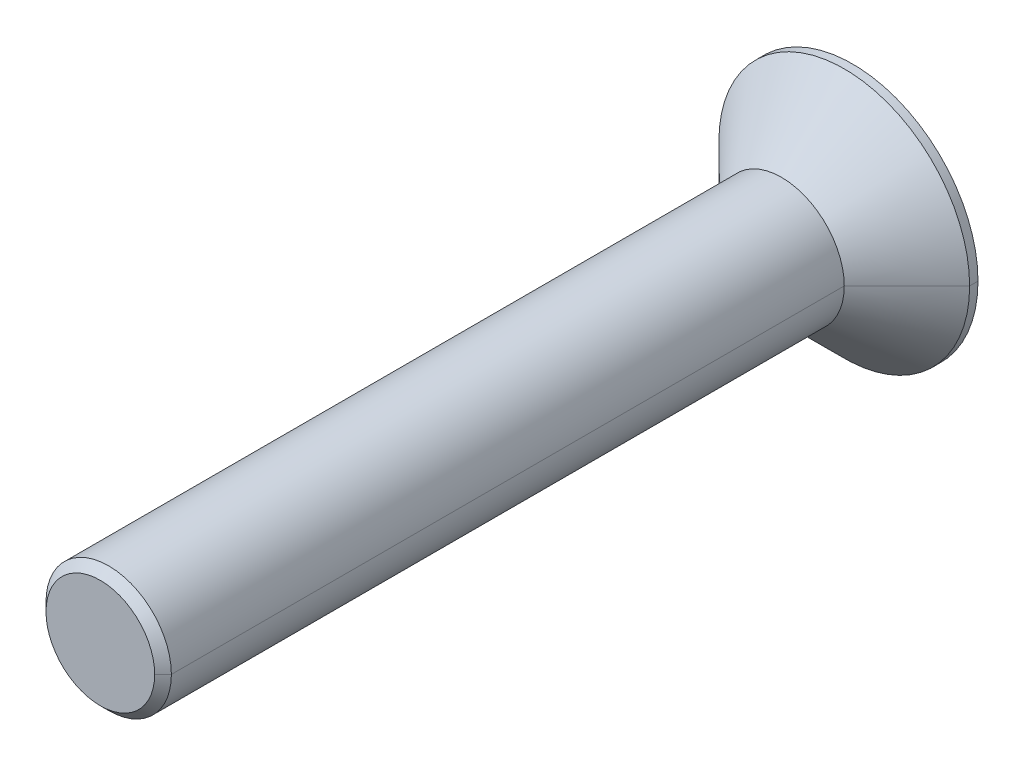
ISO-10303-21;
HEADER;
FILE_DESCRIPTION(('STEP AP214'),'2;1');
FILE_NAME('part.step','',(''),(''),'','','');
FILE_SCHEMA(('AUTOMOTIVE_DESIGN { 1 0 10303 214 1 1 1 1 }'));
ENDSEC;
DATA;
#1=APPLICATION_CONTEXT('core data for automotive mechanical design processes');
#2=APPLICATION_PROTOCOL_DEFINITION('international standard','automotive_design',2000,#1);
#3=PRODUCT_CONTEXT('',#1,'mechanical');
#4=PRODUCT('Part','Part','',(#3));
#5=PRODUCT_RELATED_PRODUCT_CATEGORY('part','',(#4));
#6=PRODUCT_DEFINITION_FORMATION('','',#4);
#7=PRODUCT_DEFINITION_CONTEXT('part definition',#1,'design');
#8=PRODUCT_DEFINITION('design','',#6,#7);
#9=PRODUCT_DEFINITION_SHAPE('','',#8);
#10=(LENGTH_UNIT() NAMED_UNIT(*) SI_UNIT(.MILLI.,.METRE.));
#11=(NAMED_UNIT(*) PLANE_ANGLE_UNIT() SI_UNIT($,.RADIAN.));
#12=(NAMED_UNIT(*) SI_UNIT($,.STERADIAN.) SOLID_ANGLE_UNIT());
#13=UNCERTAINTY_MEASURE_WITH_UNIT(LENGTH_MEASURE(1.E-05),#10,'distance_accuracy_value','');
#14=(GEOMETRIC_REPRESENTATION_CONTEXT(3) GLOBAL_UNCERTAINTY_ASSIGNED_CONTEXT((#13)) GLOBAL_UNIT_ASSIGNED_CONTEXT((#10,
#11,#12)) REPRESENTATION_CONTEXT('',''));
#15=CARTESIAN_POINT('',(0.,0.,0.));
#16=DIRECTION('',(0.,0.,1.));
#17=DIRECTION('',(1.,0.,0.));
#18=AXIS2_PLACEMENT_3D('',#15,#16,#17);
#19=CARTESIAN_POINT('',(0.,0.,-0.2));
#20=DIRECTION('',(0.,0.,-1.));
#21=DIRECTION('',(0.,-1.,0.));
#22=AXIS2_PLACEMENT_3D('',#19,#20,#21);
#23=PLANE('',#22);
#24=DIRECTION('',(-0.5,-0.866025403784439,0.));
#25=VECTOR('',#24,1.);
#26=CARTESIAN_POINT('',(1.15470053837925,0.,-0.2));
#27=LINE('',#26,#25);
#28=CARTESIAN_POINT('',(1.15470053837925,0.,-0.2));
#29=VERTEX_POINT('',#28);
#30=CARTESIAN_POINT('',(0.577350269189626,-1.,-0.2));
#31=VERTEX_POINT('',#30);
#32=EDGE_CURVE('E229',#29,#31,#27,.T.);
#33=ORIENTED_EDGE('',*,*,#32,.T.);
#34=DIRECTION('',(-1.,0.,0.));
#35=VECTOR('',#34,1.);
#36=CARTESIAN_POINT('',(0.577350269189626,-1.,-0.2));
#37=LINE('',#36,#35);
#38=CARTESIAN_POINT('',(-0.577350269189626,-1.,-0.2));
#39=VERTEX_POINT('',#38);
#40=EDGE_CURVE('E11',#31,#39,#37,.T.);
#41=ORIENTED_EDGE('',*,*,#40,.T.);
#42=DIRECTION('',(-0.5,0.866025403784439,0.));
#43=VECTOR('',#42,1.);
#44=CARTESIAN_POINT('',(-0.577350269189626,-1.,-0.2));
#45=LINE('',#44,#43);
#46=CARTESIAN_POINT('',(-1.15470053837925,0.,-0.2));
#47=VERTEX_POINT('',#46);
#48=EDGE_CURVE('E45',#39,#47,#45,.T.);
#49=ORIENTED_EDGE('',*,*,#48,.T.);
#50=DIRECTION('',(0.5,0.866025403784439,0.));
#51=VECTOR('',#50,1.);
#52=CARTESIAN_POINT('',(-1.15470053837925,0.,-0.2));
#53=LINE('',#52,#51);
#54=CARTESIAN_POINT('',(-0.577350269189627,1.,-0.2));
#55=VERTEX_POINT('',#54);
#56=EDGE_CURVE('E165',#47,#55,#53,.T.);
#57=ORIENTED_EDGE('',*,*,#56,.T.);
#58=DIRECTION('',(1.,0.,0.));
#59=VECTOR('',#58,1.);
#60=CARTESIAN_POINT('',(-0.577350269189627,1.,-0.2));
#61=LINE('',#60,#59);
#62=CARTESIAN_POINT('',(0.577350269189626,1.,-0.2));
#63=VERTEX_POINT('',#62);
#64=EDGE_CURVE('E166',#55,#63,#61,.T.);
#65=ORIENTED_EDGE('',*,*,#64,.T.);
#66=DIRECTION('',(0.5,-0.866025403784439,0.));
#67=VECTOR('',#66,1.);
#68=CARTESIAN_POINT('',(0.577350269189626,1.,-0.2));
#69=LINE('',#68,#67);
#70=EDGE_CURVE('E179',#63,#29,#69,.T.);
#71=ORIENTED_EDGE('',*,*,#70,.T.);
#72=EDGE_LOOP('',(#33,#41,#49,#57,#65,#71));
#73=FACE_BOUND('',#72,.T.);
#74=ADVANCED_FACE('F17',(#73),#23,.T.);
#75=CARTESIAN_POINT('',(0.577350269189626,-1.,-0.2));
#76=DIRECTION('',(0.,-1.,0.));
#77=DIRECTION('',(0.,0.,-1.));
#78=AXIS2_PLACEMENT_3D('',#75,#76,#77);
#79=PLANE('',#78);
#80=DIRECTION('',(-1.,0.,0.));
#81=VECTOR('',#80,1.);
#82=CARTESIAN_POINT('',(0.577350269189626,-1.,-1.7));
#83=LINE('',#82,#81);
#84=CARTESIAN_POINT('',(0.577350269189626,-1.,-1.7));
#85=VERTEX_POINT('',#84);
#86=CARTESIAN_POINT('',(-0.577350269189626,-1.,-1.7));
#87=VERTEX_POINT('',#86);
#88=EDGE_CURVE('E140',#85,#87,#83,.T.);
#89=ORIENTED_EDGE('',*,*,#88,.T.);
#90=DIRECTION('',(0.,0.,-1.));
#91=VECTOR('',#90,1.);
#92=CARTESIAN_POINT('',(-0.577350269189626,-1.,-0.2));
#93=LINE('',#92,#91);
#94=EDGE_CURVE('E20',#39,#87,#93,.T.);
#95=ORIENTED_EDGE('',*,*,#94,.F.);
#96=ORIENTED_EDGE('',*,*,#40,.F.);
#97=DIRECTION('',(0.,0.,-1.));
#98=VECTOR('',#97,1.);
#99=CARTESIAN_POINT('',(0.577350269189626,-1.,-0.2));
#100=LINE('',#99,#98);
#101=EDGE_CURVE('E226',#31,#85,#100,.T.);
#102=ORIENTED_EDGE('',*,*,#101,.T.);
#103=EDGE_LOOP('',(#89,#95,#96,#102));
#104=FACE_BOUND('',#103,.T.);
#105=ADVANCED_FACE('F258',(#104),#79,.F.);
#106=CARTESIAN_POINT('',(-0.577350269189626,-1.,-0.2));
#107=DIRECTION('',(-0.866025403784439,-0.5,0.));
#108=DIRECTION('',(-0.5,0.866025403784439,0.));
#109=AXIS2_PLACEMENT_3D('',#106,#107,#108);
#110=PLANE('',#109);
#111=DIRECTION('',(-0.5,0.866025403784439,0.));
#112=VECTOR('',#111,1.);
#113=CARTESIAN_POINT('',(-0.577350269189626,-1.,-1.7));
#114=LINE('',#113,#112);
#115=CARTESIAN_POINT('',(-1.15470053837925,0.,-1.7));
#116=VERTEX_POINT('',#115);
#117=EDGE_CURVE('E222',#87,#116,#114,.T.);
#118=ORIENTED_EDGE('',*,*,#117,.T.);
#119=DIRECTION('',(0.,0.,-1.));
#120=VECTOR('',#119,1.);
#121=CARTESIAN_POINT('',(-1.15470053837925,0.,-0.2));
#122=LINE('',#121,#120);
#123=EDGE_CURVE('E240',#47,#116,#122,.T.);
#124=ORIENTED_EDGE('',*,*,#123,.F.);
#125=ORIENTED_EDGE('',*,*,#48,.F.);
#126=ORIENTED_EDGE('',*,*,#94,.T.);
#127=EDGE_LOOP('',(#118,#124,#125,#126));
#128=FACE_BOUND('',#127,.T.);
#129=ADVANCED_FACE('F251',(#128),#110,.F.);
#130=CARTESIAN_POINT('',(-1.15470053837925,0.,-0.2));
#131=DIRECTION('',(-0.866025403784439,0.5,0.));
#132=DIRECTION('',(0.,0.,1.));
#133=AXIS2_PLACEMENT_3D('',#130,#131,#132);
#134=PLANE('',#133);
#135=DIRECTION('',(0.5,0.866025403784439,0.));
#136=VECTOR('',#135,1.);
#137=CARTESIAN_POINT('',(-1.15470053837925,0.,-1.7));
#138=LINE('',#137,#136);
#139=CARTESIAN_POINT('',(-0.577350269189627,1.,-1.7));
#140=VERTEX_POINT('',#139);
#141=EDGE_CURVE('E218',#116,#140,#138,.T.);
#142=ORIENTED_EDGE('',*,*,#141,.T.);
#143=DIRECTION('',(0.,0.,-1.));
#144=VECTOR('',#143,1.);
#145=CARTESIAN_POINT('',(-0.577350269189627,1.,-0.2));
#146=LINE('',#145,#144);
#147=EDGE_CURVE('E162',#55,#140,#146,.T.);
#148=ORIENTED_EDGE('',*,*,#147,.F.);
#149=ORIENTED_EDGE('',*,*,#56,.F.);
#150=ORIENTED_EDGE('',*,*,#123,.T.);
#151=EDGE_LOOP('',(#142,#148,#149,#150));
#152=FACE_BOUND('',#151,.T.);
#153=ADVANCED_FACE('F275',(#152),#134,.F.);
#154=CARTESIAN_POINT('',(-0.577350269189627,1.,-0.2));
#155=DIRECTION('',(0.,1.,0.));
#156=DIRECTION('',(1.,0.,0.));
#157=AXIS2_PLACEMENT_3D('',#154,#155,#156);
#158=PLANE('',#157);
#159=DIRECTION('',(1.,0.,0.));
#160=VECTOR('',#159,1.);
#161=CARTESIAN_POINT('',(-0.577350269189627,1.,-1.7));
#162=LINE('',#161,#160);
#163=CARTESIAN_POINT('',(0.577350269189626,1.,-1.7));
#164=VERTEX_POINT('',#163);
#165=EDGE_CURVE('E214',#140,#164,#162,.T.);
#166=ORIENTED_EDGE('',*,*,#165,.T.);
#167=DIRECTION('',(0.,0.,-1.));
#168=VECTOR('',#167,1.);
#169=CARTESIAN_POINT('',(0.577350269189626,1.,-0.2));
#170=LINE('',#169,#168);
#171=EDGE_CURVE('E182',#63,#164,#170,.T.);
#172=ORIENTED_EDGE('',*,*,#171,.F.);
#173=ORIENTED_EDGE('',*,*,#64,.F.);
#174=ORIENTED_EDGE('',*,*,#147,.T.);
#175=EDGE_LOOP('',(#166,#172,#173,#174));
#176=FACE_BOUND('',#175,.T.);
#177=ADVANCED_FACE('F271',(#176),#158,.F.);
#178=CARTESIAN_POINT('',(0.577350269189626,1.,-0.2));
#179=DIRECTION('',(0.866025403784439,0.5,0.));
#180=DIRECTION('',(0.,0.,-1.));
#181=AXIS2_PLACEMENT_3D('',#178,#179,#180);
#182=PLANE('',#181);
#183=DIRECTION('',(0.5,-0.866025403784439,0.));
#184=VECTOR('',#183,1.);
#185=CARTESIAN_POINT('',(0.577350269189626,1.,-1.7));
#186=LINE('',#185,#184);
#187=CARTESIAN_POINT('',(1.15470053837925,0.,-1.7));
#188=VERTEX_POINT('',#187);
#189=EDGE_CURVE('E210',#164,#188,#186,.T.);
#190=ORIENTED_EDGE('',*,*,#189,.T.);
#191=DIRECTION('',(0.,0.,-1.));
#192=VECTOR('',#191,1.);
#193=CARTESIAN_POINT('',(1.15470053837925,0.,-0.2));
#194=LINE('',#193,#192);
#195=EDGE_CURVE('E183',#29,#188,#194,.T.);
#196=ORIENTED_EDGE('',*,*,#195,.F.);
#197=ORIENTED_EDGE('',*,*,#70,.F.);
#198=ORIENTED_EDGE('',*,*,#171,.T.);
#199=EDGE_LOOP('',(#190,#196,#197,#198));
#200=FACE_BOUND('',#199,.T.);
#201=ADVANCED_FACE('F266',(#200),#182,.F.);
#202=CARTESIAN_POINT('',(1.15470053837925,0.,-0.2));
#203=DIRECTION('',(0.866025403784439,-0.5,0.));
#204=DIRECTION('',(0.,0.,-1.));
#205=AXIS2_PLACEMENT_3D('',#202,#203,#204);
#206=PLANE('',#205);
#207=DIRECTION('',(-0.5,-0.866025403784439,0.));
#208=VECTOR('',#207,1.);
#209=CARTESIAN_POINT('',(1.15470053837925,0.,-1.7));
#210=LINE('',#209,#208);
#211=EDGE_CURVE('E206',#188,#85,#210,.T.);
#212=ORIENTED_EDGE('',*,*,#211,.T.);
#213=ORIENTED_EDGE('',*,*,#101,.F.);
#214=ORIENTED_EDGE('',*,*,#32,.F.);
#215=ORIENTED_EDGE('',*,*,#195,.T.);
#216=EDGE_LOOP('',(#212,#213,#214,#215));
#217=FACE_BOUND('',#216,.T.);
#218=ADVANCED_FACE('F262',(#217),#206,.F.);
#219=CARTESIAN_POINT('',(0.,0.,16.3));
#220=DIRECTION('',(0.,0.,-1.));
#221=DIRECTION('',(-1.,0.,0.));
#222=AXIS2_PLACEMENT_3D('',#219,#220,#221);
#223=CONICAL_SURFACE('',#222,1.3,0.785398163397446);
#224=DIRECTION('',(0.707106781186546,0.,-0.707106781186549));
#225=VECTOR('',#224,1.);
#226=CARTESIAN_POINT('',(1.3,0.,16.3));
#227=LINE('',#226,#225);
#228=CARTESIAN_POINT('',(1.3,0.,16.3));
#229=VERTEX_POINT('',#228);
#230=CARTESIAN_POINT('',(1.5,0.,16.1));
#231=VERTEX_POINT('',#230);
#232=EDGE_CURVE('E331',#229,#231,#227,.T.);
#233=ORIENTED_EDGE('',*,*,#232,.F.);
#234=CARTESIAN_POINT('',(0.,0.,16.3));
#235=DIRECTION('',(0.,0.,1.));
#236=DIRECTION('',(1.,0.,0.));
#237=AXIS2_PLACEMENT_3D('',#234,#235,#236);
#238=CIRCLE('',#237,1.3);
#239=CARTESIAN_POINT('',(-1.3,0.,16.3));
#240=VERTEX_POINT('',#239);
#241=EDGE_CURVE('E141',#240,#229,#238,.T.);
#242=ORIENTED_EDGE('',*,*,#241,.F.);
#243=DIRECTION('',(-0.707106781186546,0.,-0.707106781186549));
#244=VECTOR('',#243,1.);
#245=CARTESIAN_POINT('',(-1.3,0.,16.3));
#246=LINE('',#245,#244);
#247=CARTESIAN_POINT('',(-1.5,0.,16.1));
#248=VERTEX_POINT('',#247);
#249=EDGE_CURVE('E157',#240,#248,#246,.T.);
#250=ORIENTED_EDGE('',*,*,#249,.T.);
#251=CARTESIAN_POINT('',(0.,0.,16.1));
#252=DIRECTION('',(0.,0.,-1.));
#253=DIRECTION('',(1.,0.,0.));
#254=AXIS2_PLACEMENT_3D('',#251,#252,#253);
#255=CIRCLE('',#254,1.5);
#256=EDGE_CURVE('E177',#231,#248,#255,.T.);
#257=ORIENTED_EDGE('',*,*,#256,.F.);
#258=EDGE_LOOP('',(#233,#242,#250,#257));
#259=FACE_BOUND('',#258,.T.);
#260=ADVANCED_FACE('F292',(#259),#223,.T.);
#261=CARTESIAN_POINT('',(0.,0.,-1.7));
#262=DIRECTION('',(0.,0.,1.));
#263=DIRECTION('',(1.,0.,0.));
#264=AXIS2_PLACEMENT_3D('',#261,#262,#263);
#265=PLANE('',#264);
#266=ORIENTED_EDGE('',*,*,#88,.F.);
#267=ORIENTED_EDGE('',*,*,#211,.F.);
#268=ORIENTED_EDGE('',*,*,#189,.F.);
#269=ORIENTED_EDGE('',*,*,#165,.F.);
#270=ORIENTED_EDGE('',*,*,#141,.F.);
#271=ORIENTED_EDGE('',*,*,#117,.F.);
#272=EDGE_LOOP('',(#266,#267,#268,#269,#270,#271));
#273=FACE_BOUND('',#272,.T.);
#274=CARTESIAN_POINT('',(0.,0.,-1.7));
#275=DIRECTION('',(0.,0.,-1.));
#276=DIRECTION('',(-1.,0.,0.));
#277=AXIS2_PLACEMENT_3D('',#274,#275,#276);
#278=CIRCLE('',#277,3.);
#279=CARTESIAN_POINT('',(-3.,0.,-1.7));
#280=VERTEX_POINT('',#279);
#281=CARTESIAN_POINT('',(3.,0.,-1.7));
#282=VERTEX_POINT('',#281);
#283=EDGE_CURVE('E143',#280,#282,#278,.T.);
#284=ORIENTED_EDGE('',*,*,#283,.T.);
#285=CARTESIAN_POINT('',(0.,0.,-1.7));
#286=DIRECTION('',(0.,0.,-1.));
#287=DIRECTION('',(-1.,0.,0.));
#288=AXIS2_PLACEMENT_3D('',#285,#286,#287);
#289=CIRCLE('',#288,3.);
#290=EDGE_CURVE('E129',#282,#280,#289,.T.);
#291=ORIENTED_EDGE('',*,*,#290,.T.);
#292=EDGE_LOOP('',(#284,#291));
#293=FACE_BOUND('',#292,.T.);
#294=ADVANCED_FACE('F144',(#273,#293),#265,.F.);
#295=CARTESIAN_POINT('',(0.,0.,16.3));
#296=DIRECTION('',(0.,0.,-1.));
#297=DIRECTION('',(-1.,0.,0.));
#298=AXIS2_PLACEMENT_3D('',#295,#296,#297);
#299=CYLINDRICAL_SURFACE('',#298,3.);
#300=DIRECTION('',(0.,0.,-1.));
#301=VECTOR('',#300,1.);
#302=CARTESIAN_POINT('',(3.,0.,16.3));
#303=LINE('',#302,#301);
#304=CARTESIAN_POINT('',(3.,0.,-1.5));
#305=VERTEX_POINT('',#304);
#306=EDGE_CURVE('E133',#305,#282,#303,.T.);
#307=ORIENTED_EDGE('',*,*,#306,.F.);
#308=CARTESIAN_POINT('',(0.,0.,-1.5));
#309=DIRECTION('',(0.,0.,1.));
#310=DIRECTION('',(-1.,0.,0.));
#311=AXIS2_PLACEMENT_3D('',#308,#309,#310);
#312=CIRCLE('',#311,3.);
#313=CARTESIAN_POINT('',(-3.,0.,-1.5));
#314=VERTEX_POINT('',#313);
#315=EDGE_CURVE('E178',#314,#305,#312,.T.);
#316=ORIENTED_EDGE('',*,*,#315,.F.);
#317=DIRECTION('',(0.,0.,-1.));
#318=VECTOR('',#317,1.);
#319=CARTESIAN_POINT('',(-3.,0.,16.3));
#320=LINE('',#319,#318);
#321=EDGE_CURVE('E136',#314,#280,#320,.T.);
#322=ORIENTED_EDGE('',*,*,#321,.T.);
#323=ORIENTED_EDGE('',*,*,#290,.F.);
#324=EDGE_LOOP('',(#307,#316,#322,#323));
#325=FACE_BOUND('',#324,.T.);
#326=ADVANCED_FACE('F131',(#325),#299,.T.);
#327=CARTESIAN_POINT('',(0.,0.,16.3));
#328=DIRECTION('',(0.,0.,1.));
#329=DIRECTION('',(1.,0.,0.));
#330=AXIS2_PLACEMENT_3D('',#327,#328,#329);
#331=PLANE('',#330);
#332=ORIENTED_EDGE('',*,*,#241,.T.);
#333=CARTESIAN_POINT('',(0.,0.,16.3));
#334=DIRECTION('',(0.,0.,1.));
#335=DIRECTION('',(1.,0.,0.));
#336=AXIS2_PLACEMENT_3D('',#333,#334,#335);
#337=CIRCLE('',#336,1.3);
#338=EDGE_CURVE('E339',#229,#240,#337,.T.);
#339=ORIENTED_EDGE('',*,*,#338,.T.);
#340=EDGE_LOOP('',(#332,#339));
#341=FACE_BOUND('',#340,.T.);
#342=ADVANCED_FACE('F295',(#341),#331,.T.);
#343=CARTESIAN_POINT('',(0.,0.,16.3));
#344=DIRECTION('',(0.,0.,-1.));
#345=DIRECTION('',(-1.,0.,0.));
#346=AXIS2_PLACEMENT_3D('',#343,#344,#345);
#347=CYLINDRICAL_SURFACE('',#346,1.5);
#348=DIRECTION('',(0.,0.,-1.));
#349=VECTOR('',#348,1.);
#350=CARTESIAN_POINT('',(1.5,0.,16.3));
#351=LINE('',#350,#349);
#352=CARTESIAN_POINT('',(1.5,0.,0.));
#353=VERTEX_POINT('',#352);
#354=EDGE_CURVE('E169',#231,#353,#351,.T.);
#355=ORIENTED_EDGE('',*,*,#354,.F.);
#356=ORIENTED_EDGE('',*,*,#256,.T.);
#357=DIRECTION('',(0.,0.,-1.));
#358=VECTOR('',#357,1.);
#359=CARTESIAN_POINT('',(-1.5,0.,16.3));
#360=LINE('',#359,#358);
#361=CARTESIAN_POINT('',(-1.5,0.,0.));
#362=VERTEX_POINT('',#361);
#363=EDGE_CURVE('E187',#248,#362,#360,.T.);
#364=ORIENTED_EDGE('',*,*,#363,.T.);
#365=CARTESIAN_POINT('',(0.,0.,0.));
#366=DIRECTION('',(0.,0.,1.));
#367=DIRECTION('',(1.,0.,0.));
#368=AXIS2_PLACEMENT_3D('',#365,#366,#367);
#369=CIRCLE('',#368,1.5);
#370=EDGE_CURVE('E191',#362,#353,#369,.T.);
#371=ORIENTED_EDGE('',*,*,#370,.T.);
#372=EDGE_LOOP('',(#355,#356,#364,#371));
#373=FACE_BOUND('',#372,.T.);
#374=ADVANCED_FACE('F298',(#373),#347,.T.);
#375=CARTESIAN_POINT('',(0.,0.,0.));
#376=DIRECTION('',(0.,0.,-1.));
#377=DIRECTION('',(1.,0.,0.));
#378=AXIS2_PLACEMENT_3D('',#375,#376,#377);
#379=CONICAL_SURFACE('',#378,1.5,0.78539816339745);
#380=DIRECTION('',(-0.707106781186549,0.,-0.707106781186546));
#381=VECTOR('',#380,1.);
#382=CARTESIAN_POINT('',(-1.5,0.,0.));
#383=LINE('',#382,#381);
#384=EDGE_CURVE('E192',#362,#314,#383,.T.);
#385=ORIENTED_EDGE('',*,*,#384,.F.);
#386=CARTESIAN_POINT('',(0.,0.,0.));
#387=DIRECTION('',(0.,0.,1.));
#388=DIRECTION('',(1.,0.,0.));
#389=AXIS2_PLACEMENT_3D('',#386,#387,#388);
#390=CIRCLE('',#389,1.5);
#391=EDGE_CURVE('E173',#353,#362,#390,.T.);
#392=ORIENTED_EDGE('',*,*,#391,.F.);
#393=DIRECTION('',(0.707106781186549,0.,-0.707106781186546));
#394=VECTOR('',#393,1.);
#395=CARTESIAN_POINT('',(1.5,0.,0.));
#396=LINE('',#395,#394);
#397=EDGE_CURVE('E174',#353,#305,#396,.T.);
#398=ORIENTED_EDGE('',*,*,#397,.T.);
#399=CARTESIAN_POINT('',(0.,0.,-1.5));
#400=DIRECTION('',(0.,0.,1.));
#401=DIRECTION('',(-1.,0.,0.));
#402=AXIS2_PLACEMENT_3D('',#399,#400,#401);
#403=CIRCLE('',#402,3.);
#404=EDGE_CURVE('E150',#305,#314,#403,.T.);
#405=ORIENTED_EDGE('',*,*,#404,.T.);
#406=EDGE_LOOP('',(#385,#392,#398,#405));
#407=FACE_BOUND('',#406,.T.);
#408=ADVANCED_FACE('F302',(#407),#379,.T.);
#409=CARTESIAN_POINT('',(0.,0.,0.));
#410=DIRECTION('',(0.,0.,-1.));
#411=DIRECTION('',(1.,0.,0.));
#412=AXIS2_PLACEMENT_3D('',#409,#410,#411);
#413=CONICAL_SURFACE('',#412,1.5,0.78539816339745);
#414=ORIENTED_EDGE('',*,*,#370,.F.);
#415=ORIENTED_EDGE('',*,*,#384,.T.);
#416=ORIENTED_EDGE('',*,*,#315,.T.);
#417=ORIENTED_EDGE('',*,*,#397,.F.);
#418=EDGE_LOOP('',(#414,#415,#416,#417));
#419=FACE_BOUND('',#418,.T.);
#420=ADVANCED_FACE('F310',(#419),#413,.T.);
#421=CARTESIAN_POINT('',(0.,0.,16.3));
#422=DIRECTION('',(0.,0.,-1.));
#423=DIRECTION('',(-1.,0.,0.));
#424=AXIS2_PLACEMENT_3D('',#421,#422,#423);
#425=CYLINDRICAL_SURFACE('',#424,1.5);
#426=CARTESIAN_POINT('',(0.,0.,16.1));
#427=DIRECTION('',(0.,0.,-1.));
#428=DIRECTION('',(1.,0.,0.));
#429=AXIS2_PLACEMENT_3D('',#426,#427,#428);
#430=CIRCLE('',#429,1.5);
#431=EDGE_CURVE('E338',#248,#231,#430,.T.);
#432=ORIENTED_EDGE('',*,*,#431,.T.);
#433=ORIENTED_EDGE('',*,*,#354,.T.);
#434=ORIENTED_EDGE('',*,*,#391,.T.);
#435=ORIENTED_EDGE('',*,*,#363,.F.);
#436=EDGE_LOOP('',(#432,#433,#434,#435));
#437=FACE_BOUND('',#436,.T.);
#438=ADVANCED_FACE('F312',(#437),#425,.T.);
#439=CARTESIAN_POINT('',(0.,0.,16.3));
#440=DIRECTION('',(0.,0.,-1.));
#441=DIRECTION('',(-1.,0.,0.));
#442=AXIS2_PLACEMENT_3D('',#439,#440,#441);
#443=CYLINDRICAL_SURFACE('',#442,3.);
#444=ORIENTED_EDGE('',*,*,#404,.F.);
#445=ORIENTED_EDGE('',*,*,#306,.T.);
#446=ORIENTED_EDGE('',*,*,#283,.F.);
#447=ORIENTED_EDGE('',*,*,#321,.F.);
#448=EDGE_LOOP('',(#444,#445,#446,#447));
#449=FACE_BOUND('',#448,.T.);
#450=ADVANCED_FACE('F148',(#449),#443,.T.);
#451=CARTESIAN_POINT('',(0.,0.,16.3));
#452=DIRECTION('',(0.,0.,-1.));
#453=DIRECTION('',(-1.,0.,0.));
#454=AXIS2_PLACEMENT_3D('',#451,#452,#453);
#455=CONICAL_SURFACE('',#454,1.3,0.785398163397446);
#456=ORIENTED_EDGE('',*,*,#338,.F.);
#457=ORIENTED_EDGE('',*,*,#232,.T.);
#458=ORIENTED_EDGE('',*,*,#431,.F.);
#459=ORIENTED_EDGE('',*,*,#249,.F.);
#460=EDGE_LOOP('',(#456,#457,#458,#459));
#461=FACE_BOUND('',#460,.T.);
#462=ADVANCED_FACE('F318',(#461),#455,.T.);
#463=CLOSED_SHELL('',(#74,#105,#129,#153,#177,#201,#218,#260,#294,#326,#342,#374,#408,#420,#438,
#450,#462));
#464=MANIFOLD_SOLID_BREP('B1',#463);
#465=ADVANCED_BREP_SHAPE_REPRESENTATION('',(#18,#464),#14);
#466=SHAPE_DEFINITION_REPRESENTATION(#9,#465);
ENDSEC;
END-ISO-10303-21;
